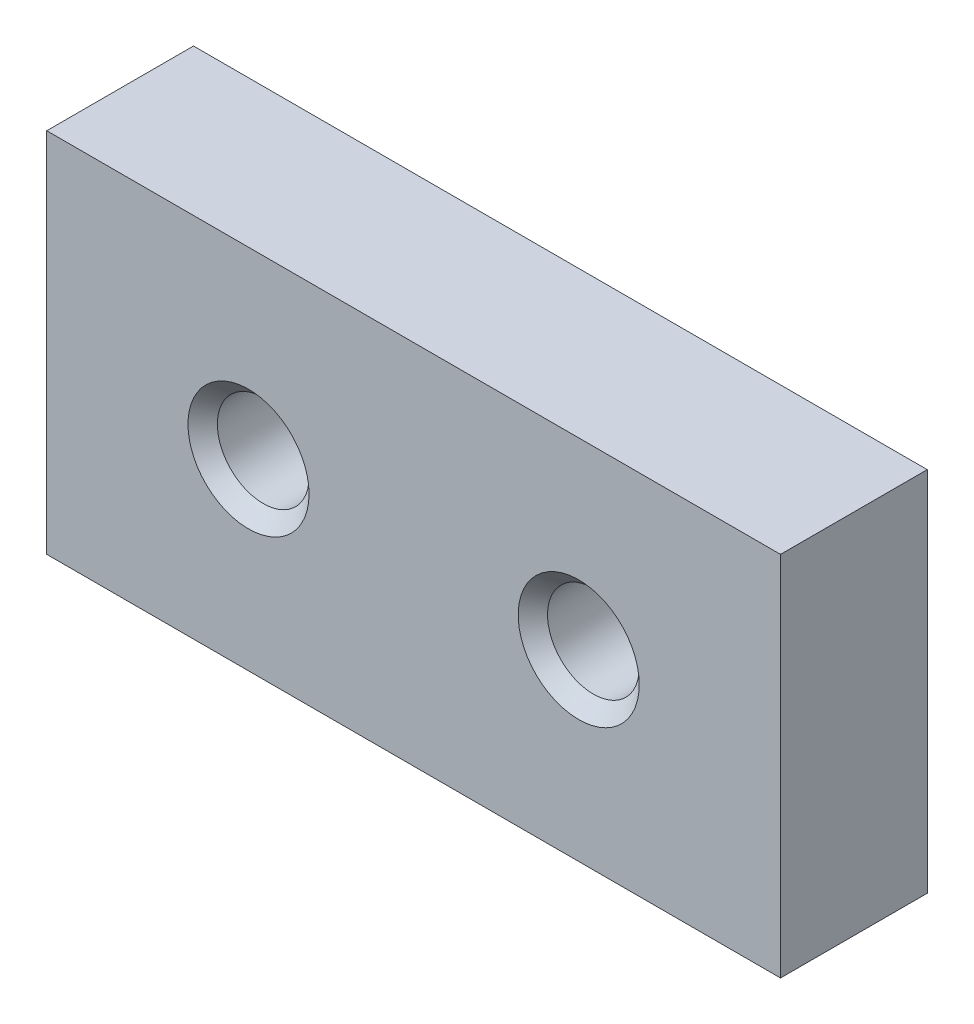
ISO-10303-21;
HEADER;
FILE_DESCRIPTION(('STEP AP214'),'2;1');
FILE_NAME('part.step','',(''),(''),'','','');
FILE_SCHEMA(('AUTOMOTIVE_DESIGN { 1 0 10303 214 1 1 1 1 }'));
ENDSEC;
DATA;
#1=APPLICATION_CONTEXT('core data for automotive mechanical design processes');
#2=APPLICATION_PROTOCOL_DEFINITION('international standard','automotive_design',2000,#1);
#3=PRODUCT_CONTEXT('',#1,'mechanical');
#4=PRODUCT('Part','Part','',(#3));
#5=PRODUCT_RELATED_PRODUCT_CATEGORY('part','',(#4));
#6=PRODUCT_DEFINITION_FORMATION('','',#4);
#7=PRODUCT_DEFINITION_CONTEXT('part definition',#1,'design');
#8=PRODUCT_DEFINITION('design','',#6,#7);
#9=PRODUCT_DEFINITION_SHAPE('','',#8);
#10=(LENGTH_UNIT() NAMED_UNIT(*) SI_UNIT(.MILLI.,.METRE.));
#11=(NAMED_UNIT(*) PLANE_ANGLE_UNIT() SI_UNIT($,.RADIAN.));
#12=(NAMED_UNIT(*) SI_UNIT($,.STERADIAN.) SOLID_ANGLE_UNIT());
#13=UNCERTAINTY_MEASURE_WITH_UNIT(LENGTH_MEASURE(1.E-05),#10,'distance_accuracy_value','');
#14=(GEOMETRIC_REPRESENTATION_CONTEXT(3) GLOBAL_UNCERTAINTY_ASSIGNED_CONTEXT((#13)) GLOBAL_UNIT_ASSIGNED_CONTEXT((#10,
#11,#12)) REPRESENTATION_CONTEXT('',''));
#15=CARTESIAN_POINT('',(0.,0.,0.));
#16=DIRECTION('',(0.,0.,1.));
#17=DIRECTION('',(1.,0.,0.));
#18=AXIS2_PLACEMENT_3D('',#15,#16,#17);
#19=CARTESIAN_POINT('',(10.,-5.,4.));
#20=DIRECTION('',(-1.,0.,0.));
#21=DIRECTION('',(0.,0.,1.));
#22=AXIS2_PLACEMENT_3D('',#19,#20,#21);
#23=PLANE('',#22);
#24=DIRECTION('',(0.,1.,0.));
#25=VECTOR('',#24,1.);
#26=CARTESIAN_POINT('',(10.,-5.,0.));
#27=LINE('',#26,#25);
#28=CARTESIAN_POINT('',(10.,-5.,0.));
#29=VERTEX_POINT('',#28);
#30=CARTESIAN_POINT('',(10.,5.,0.));
#31=VERTEX_POINT('',#30);
#32=EDGE_CURVE('E93',#29,#31,#27,.T.);
#33=ORIENTED_EDGE('',*,*,#32,.T.);
#34=DIRECTION('',(0.,0.,-1.));
#35=VECTOR('',#34,1.);
#36=CARTESIAN_POINT('',(10.,5.,4.));
#37=LINE('',#36,#35);
#38=CARTESIAN_POINT('',(10.,5.,4.));
#39=VERTEX_POINT('',#38);
#40=EDGE_CURVE('E11',#39,#31,#37,.T.);
#41=ORIENTED_EDGE('',*,*,#40,.F.);
#42=DIRECTION('',(0.,1.,0.));
#43=VECTOR('',#42,1.);
#44=CARTESIAN_POINT('',(10.,-5.,4.));
#45=LINE('',#44,#43);
#46=CARTESIAN_POINT('',(10.,-5.,4.));
#47=VERTEX_POINT('',#46);
#48=EDGE_CURVE('E81',#47,#39,#45,.T.);
#49=ORIENTED_EDGE('',*,*,#48,.F.);
#50=DIRECTION('',(0.,0.,-1.));
#51=VECTOR('',#50,1.);
#52=CARTESIAN_POINT('',(10.,-5.,4.));
#53=LINE('',#52,#51);
#54=EDGE_CURVE('E89',#47,#29,#53,.T.);
#55=ORIENTED_EDGE('',*,*,#54,.T.);
#56=EDGE_LOOP('',(#33,#41,#49,#55));
#57=FACE_BOUND('',#56,.T.);
#58=ADVANCED_FACE('F30',(#57),#23,.F.);
#59=CARTESIAN_POINT('',(-9.99999999999999,5.,4.));
#60=DIRECTION('',(0.,-1.,0.));
#61=DIRECTION('',(0.,0.,-1.));
#62=AXIS2_PLACEMENT_3D('',#59,#60,#61);
#63=PLANE('',#62);
#64=DIRECTION('',(-1.,0.,0.));
#65=VECTOR('',#64,1.);
#66=CARTESIAN_POINT('',(-9.99999999999999,5.,0.));
#67=LINE('',#66,#65);
#68=CARTESIAN_POINT('',(-9.99999999999999,5.,0.));
#69=VERTEX_POINT('',#68);
#70=EDGE_CURVE('E85',#31,#69,#67,.T.);
#71=ORIENTED_EDGE('',*,*,#70,.T.);
#72=DIRECTION('',(0.,0.,-1.));
#73=VECTOR('',#72,1.);
#74=CARTESIAN_POINT('',(-9.99999999999999,5.,4.));
#75=LINE('',#74,#73);
#76=CARTESIAN_POINT('',(-9.99999999999999,5.,4.));
#77=VERTEX_POINT('',#76);
#78=EDGE_CURVE('E38',#77,#69,#75,.T.);
#79=ORIENTED_EDGE('',*,*,#78,.F.);
#80=DIRECTION('',(-1.,0.,0.));
#81=VECTOR('',#80,1.);
#82=CARTESIAN_POINT('',(-9.99999999999999,5.,4.));
#83=LINE('',#82,#81);
#84=EDGE_CURVE('E76',#39,#77,#83,.T.);
#85=ORIENTED_EDGE('',*,*,#84,.F.);
#86=ORIENTED_EDGE('',*,*,#40,.T.);
#87=EDGE_LOOP('',(#71,#79,#85,#86));
#88=FACE_BOUND('',#87,.T.);
#89=ADVANCED_FACE('F84',(#88),#63,.F.);
#90=CARTESIAN_POINT('',(-9.99999999999999,-5.,4.));
#91=DIRECTION('',(1.,0.,0.));
#92=DIRECTION('',(0.,0.,-1.));
#93=AXIS2_PLACEMENT_3D('',#90,#91,#92);
#94=PLANE('',#93);
#95=DIRECTION('',(0.,-1.,0.));
#96=VECTOR('',#95,1.);
#97=CARTESIAN_POINT('',(-9.99999999999999,-5.,0.));
#98=LINE('',#97,#96);
#99=CARTESIAN_POINT('',(-9.99999999999999,-5.,0.));
#100=VERTEX_POINT('',#99);
#101=EDGE_CURVE('E63',#69,#100,#98,.T.);
#102=ORIENTED_EDGE('',*,*,#101,.T.);
#103=DIRECTION('',(0.,0.,-1.));
#104=VECTOR('',#103,1.);
#105=CARTESIAN_POINT('',(-9.99999999999999,-5.,4.));
#106=LINE('',#105,#104);
#107=CARTESIAN_POINT('',(-9.99999999999999,-5.,4.));
#108=VERTEX_POINT('',#107);
#109=EDGE_CURVE('E86',#108,#100,#106,.T.);
#110=ORIENTED_EDGE('',*,*,#109,.F.);
#111=DIRECTION('',(0.,-1.,0.));
#112=VECTOR('',#111,1.);
#113=CARTESIAN_POINT('',(-9.99999999999999,-5.,4.));
#114=LINE('',#113,#112);
#115=EDGE_CURVE('E79',#77,#108,#114,.T.);
#116=ORIENTED_EDGE('',*,*,#115,.F.);
#117=ORIENTED_EDGE('',*,*,#78,.T.);
#118=EDGE_LOOP('',(#102,#110,#116,#117));
#119=FACE_BOUND('',#118,.T.);
#120=ADVANCED_FACE('F87',(#119),#94,.F.);
#121=CARTESIAN_POINT('',(-9.99999999999999,-5.,4.));
#122=DIRECTION('',(0.,1.,0.));
#123=DIRECTION('',(0.,0.,1.));
#124=AXIS2_PLACEMENT_3D('',#121,#122,#123);
#125=PLANE('',#124);
#126=DIRECTION('',(1.,0.,0.));
#127=VECTOR('',#126,1.);
#128=CARTESIAN_POINT('',(-9.99999999999999,-5.,0.));
#129=LINE('',#128,#127);
#130=EDGE_CURVE('E69',#100,#29,#129,.T.);
#131=ORIENTED_EDGE('',*,*,#130,.T.);
#132=ORIENTED_EDGE('',*,*,#54,.F.);
#133=DIRECTION('',(1.,0.,0.));
#134=VECTOR('',#133,1.);
#135=CARTESIAN_POINT('',(-9.99999999999999,-5.,4.));
#136=LINE('',#135,#134);
#137=EDGE_CURVE('E46',#108,#47,#136,.T.);
#138=ORIENTED_EDGE('',*,*,#137,.F.);
#139=ORIENTED_EDGE('',*,*,#109,.T.);
#140=EDGE_LOOP('',(#131,#132,#138,#139));
#141=FACE_BOUND('',#140,.T.);
#142=ADVANCED_FACE('F101',(#141),#125,.F.);
#143=CARTESIAN_POINT('',(10.,5.,4.));
#144=DIRECTION('',(0.,0.,-1.));
#145=DIRECTION('',(-1.,0.,0.));
#146=AXIS2_PLACEMENT_3D('',#143,#144,#145);
#147=PLANE('',#146);
#148=CARTESIAN_POINT('',(-4.5,0.,4.));
#149=DIRECTION('',(0.,0.,1.));
#150=DIRECTION('',(1.,0.,0.));
#151=AXIS2_PLACEMENT_3D('',#148,#149,#150);
#152=CIRCLE('',#151,1.65);
#153=CARTESIAN_POINT('',(-2.84999999999999,0.,4.));
#154=VERTEX_POINT('',#153);
#155=EDGE_CURVE('E124',#154,#154,#152,.T.);
#156=ORIENTED_EDGE('',*,*,#155,.F.);
#157=EDGE_LOOP('',(#156));
#158=FACE_BOUND('',#157,.T.);
#159=CARTESIAN_POINT('',(4.5,0.,4.));
#160=DIRECTION('',(0.,0.,1.));
#161=DIRECTION('',(1.,0.,0.));
#162=AXIS2_PLACEMENT_3D('',#159,#160,#161);
#163=CIRCLE('',#162,1.65);
#164=CARTESIAN_POINT('',(6.15,0.,4.));
#165=VERTEX_POINT('',#164);
#166=EDGE_CURVE('E112',#165,#165,#163,.T.);
#167=ORIENTED_EDGE('',*,*,#166,.F.);
#168=EDGE_LOOP('',(#167));
#169=FACE_BOUND('',#168,.T.);
#170=ORIENTED_EDGE('',*,*,#48,.T.);
#171=ORIENTED_EDGE('',*,*,#84,.T.);
#172=ORIENTED_EDGE('',*,*,#115,.T.);
#173=ORIENTED_EDGE('',*,*,#137,.T.);
#174=EDGE_LOOP('',(#170,#171,#172,#173));
#175=FACE_BOUND('',#174,.T.);
#176=ADVANCED_FACE('F77',(#158,#169,#175),#147,.F.);
#177=CARTESIAN_POINT('',(10.,5.,0.));
#178=DIRECTION('',(0.,0.,-1.));
#179=DIRECTION('',(-1.,0.,0.));
#180=AXIS2_PLACEMENT_3D('',#177,#178,#179);
#181=PLANE('',#180);
#182=CARTESIAN_POINT('',(-4.5,0.,0.));
#183=DIRECTION('',(0.,0.,1.));
#184=DIRECTION('',(1.,0.,0.));
#185=AXIS2_PLACEMENT_3D('',#182,#183,#184);
#186=CIRCLE('',#185,1.65);
#187=CARTESIAN_POINT('',(-2.85,0.,0.));
#188=VERTEX_POINT('',#187);
#189=EDGE_CURVE('E127',#188,#188,#186,.T.);
#190=ORIENTED_EDGE('',*,*,#189,.T.);
#191=EDGE_LOOP('',(#190));
#192=FACE_BOUND('',#191,.T.);
#193=CARTESIAN_POINT('',(4.5,0.,0.));
#194=DIRECTION('',(0.,0.,1.));
#195=DIRECTION('',(1.,0.,0.));
#196=AXIS2_PLACEMENT_3D('',#193,#194,#195);
#197=CIRCLE('',#196,1.65);
#198=CARTESIAN_POINT('',(6.15,0.,0.));
#199=VERTEX_POINT('',#198);
#200=EDGE_CURVE('E115',#199,#199,#197,.T.);
#201=ORIENTED_EDGE('',*,*,#200,.T.);
#202=EDGE_LOOP('',(#201));
#203=FACE_BOUND('',#202,.T.);
#204=ORIENTED_EDGE('',*,*,#32,.F.);
#205=ORIENTED_EDGE('',*,*,#130,.F.);
#206=ORIENTED_EDGE('',*,*,#101,.F.);
#207=ORIENTED_EDGE('',*,*,#70,.F.);
#208=EDGE_LOOP('',(#204,#205,#206,#207));
#209=FACE_BOUND('',#208,.T.);
#210=ADVANCED_FACE('F104',(#192,#203,#209),#181,.T.);
#211=CARTESIAN_POINT('',(4.5,0.,0.4));
#212=DIRECTION('',(0.,0.,-1.));
#213=DIRECTION('',(-1.,0.,0.));
#214=AXIS2_PLACEMENT_3D('',#211,#212,#213);
#215=CONICAL_SURFACE('',#214,1.25,0.785398163397448);
#216=ORIENTED_EDGE('',*,*,#200,.F.);
#217=EDGE_LOOP('',(#216));
#218=FACE_BOUND('',#217,.T.);
#219=CARTESIAN_POINT('',(4.5,0.,0.4));
#220=DIRECTION('',(0.,0.,1.));
#221=DIRECTION('',(1.,0.,0.));
#222=AXIS2_PLACEMENT_3D('',#219,#220,#221);
#223=CIRCLE('',#222,1.25);
#224=CARTESIAN_POINT('',(5.75,0.,0.4));
#225=VERTEX_POINT('',#224);
#226=EDGE_CURVE('E96',#225,#225,#223,.T.);
#227=ORIENTED_EDGE('',*,*,#226,.T.);
#228=EDGE_LOOP('',(#227));
#229=FACE_BOUND('',#228,.T.);
#230=ADVANCED_FACE('F164',(#218,#229),#215,.F.);
#231=CARTESIAN_POINT('',(4.5,0.,4.));
#232=DIRECTION('',(0.,0.,1.));
#233=DIRECTION('',(1.,0.,0.));
#234=AXIS2_PLACEMENT_3D('',#231,#232,#233);
#235=CYLINDRICAL_SURFACE('',#234,1.25);
#236=ORIENTED_EDGE('',*,*,#226,.F.);
#237=EDGE_LOOP('',(#236));
#238=FACE_BOUND('',#237,.T.);
#239=CARTESIAN_POINT('',(4.5,0.,3.6));
#240=DIRECTION('',(0.,0.,1.));
#241=DIRECTION('',(1.,0.,0.));
#242=AXIS2_PLACEMENT_3D('',#239,#240,#241);
#243=CIRCLE('',#242,1.25);
#244=CARTESIAN_POINT('',(5.75,0.,3.6));
#245=VERTEX_POINT('',#244);
#246=EDGE_CURVE('E109',#245,#245,#243,.T.);
#247=ORIENTED_EDGE('',*,*,#246,.T.);
#248=EDGE_LOOP('',(#247));
#249=FACE_BOUND('',#248,.T.);
#250=ADVANCED_FACE('F158',(#238,#249),#235,.F.);
#251=CARTESIAN_POINT('',(4.5,0.,4.));
#252=DIRECTION('',(0.,0.,1.));
#253=DIRECTION('',(1.,0.,0.));
#254=AXIS2_PLACEMENT_3D('',#251,#252,#253);
#255=CONICAL_SURFACE('',#254,1.65,0.785398163397447);
#256=ORIENTED_EDGE('',*,*,#246,.F.);
#257=EDGE_LOOP('',(#256));
#258=FACE_BOUND('',#257,.T.);
#259=ORIENTED_EDGE('',*,*,#166,.T.);
#260=EDGE_LOOP('',(#259));
#261=FACE_BOUND('',#260,.T.);
#262=ADVANCED_FACE('F137',(#258,#261),#255,.F.);
#263=CARTESIAN_POINT('',(-4.5,0.,0.4));
#264=DIRECTION('',(0.,0.,-1.));
#265=DIRECTION('',(-1.,0.,0.));
#266=AXIS2_PLACEMENT_3D('',#263,#264,#265);
#267=CONICAL_SURFACE('',#266,1.25,0.785398163397448);
#268=ORIENTED_EDGE('',*,*,#189,.F.);
#269=EDGE_LOOP('',(#268));
#270=FACE_BOUND('',#269,.T.);
#271=CARTESIAN_POINT('',(-4.5,0.,0.4));
#272=DIRECTION('',(0.,0.,1.));
#273=DIRECTION('',(1.,0.,0.));
#274=AXIS2_PLACEMENT_3D('',#271,#272,#273);
#275=CIRCLE('',#274,1.25);
#276=CARTESIAN_POINT('',(-3.25,0.,0.4));
#277=VERTEX_POINT('',#276);
#278=EDGE_CURVE('E118',#277,#277,#275,.T.);
#279=ORIENTED_EDGE('',*,*,#278,.T.);
#280=EDGE_LOOP('',(#279));
#281=FACE_BOUND('',#280,.T.);
#282=ADVANCED_FACE('F133',(#270,#281),#267,.F.);
#283=CARTESIAN_POINT('',(-4.5,0.,4.));
#284=DIRECTION('',(0.,0.,1.));
#285=DIRECTION('',(1.,0.,0.));
#286=AXIS2_PLACEMENT_3D('',#283,#284,#285);
#287=CYLINDRICAL_SURFACE('',#286,1.25);
#288=ORIENTED_EDGE('',*,*,#278,.F.);
#289=EDGE_LOOP('',(#288));
#290=FACE_BOUND('',#289,.T.);
#291=CARTESIAN_POINT('',(-4.5,0.,3.6));
#292=DIRECTION('',(0.,0.,1.));
#293=DIRECTION('',(1.,0.,0.));
#294=AXIS2_PLACEMENT_3D('',#291,#292,#293);
#295=CIRCLE('',#294,1.25);
#296=CARTESIAN_POINT('',(-3.25,0.,3.6));
#297=VERTEX_POINT('',#296);
#298=EDGE_CURVE('E121',#297,#297,#295,.T.);
#299=ORIENTED_EDGE('',*,*,#298,.T.);
#300=EDGE_LOOP('',(#299));
#301=FACE_BOUND('',#300,.T.);
#302=ADVANCED_FACE('F136',(#290,#301),#287,.F.);
#303=CARTESIAN_POINT('',(-4.5,0.,4.));
#304=DIRECTION('',(0.,0.,1.));
#305=DIRECTION('',(1.,0.,0.));
#306=AXIS2_PLACEMENT_3D('',#303,#304,#305);
#307=CONICAL_SURFACE('',#306,1.65,0.785398163397447);
#308=ORIENTED_EDGE('',*,*,#298,.F.);
#309=EDGE_LOOP('',(#308));
#310=FACE_BOUND('',#309,.T.);
#311=ORIENTED_EDGE('',*,*,#155,.T.);
#312=EDGE_LOOP('',(#311));
#313=FACE_BOUND('',#312,.T.);
#314=ADVANCED_FACE('F143',(#310,#313),#307,.F.);
#315=CLOSED_SHELL('',(#58,#89,#120,#142,#176,#210,#230,#250,#262,#282,#302,#314));
#316=MANIFOLD_SOLID_BREP('B2',#315);
#317=ADVANCED_BREP_SHAPE_REPRESENTATION('',(#18,#316),#14);
#318=SHAPE_DEFINITION_REPRESENTATION(#9,#317);
ENDSEC;
END-ISO-10303-21;
